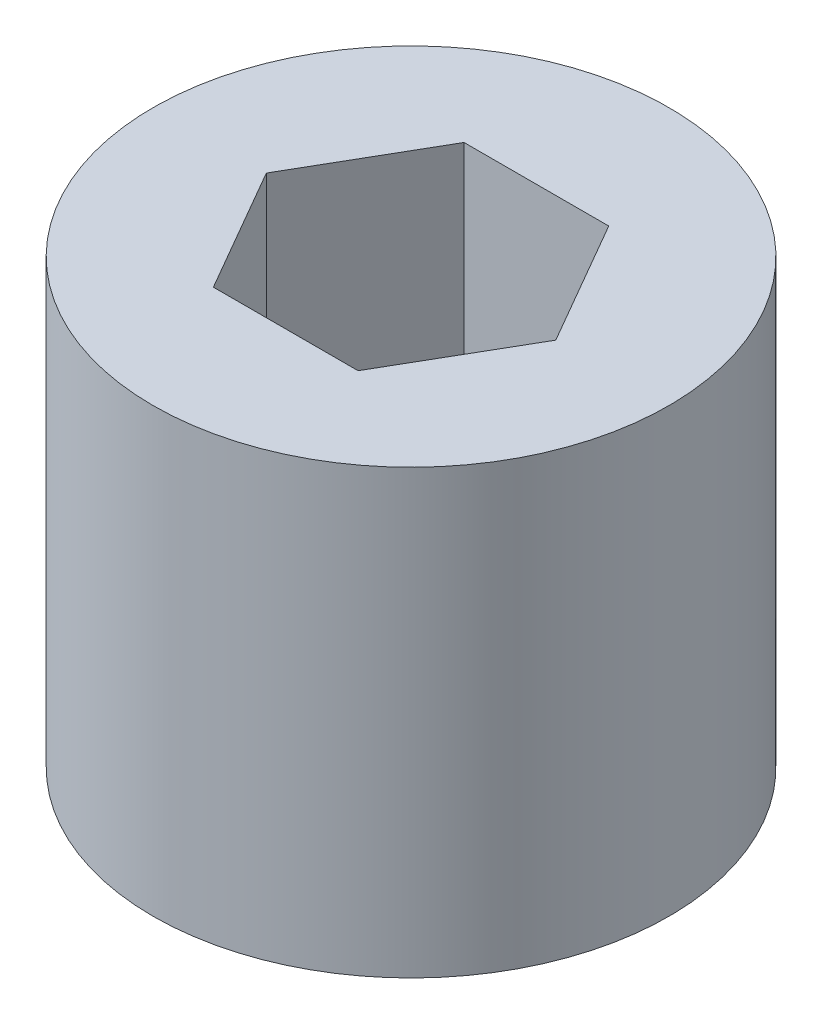
ISO-10303-21;
HEADER;
FILE_DESCRIPTION(('STEP AP214'),'2;1');
FILE_NAME('part.step','',(''),(''),'','','');
FILE_SCHEMA(('AUTOMOTIVE_DESIGN { 1 0 10303 214 1 1 1 1 }'));
ENDSEC;
DATA;
#1=APPLICATION_CONTEXT('core data for automotive mechanical design processes');
#2=APPLICATION_PROTOCOL_DEFINITION('international standard','automotive_design',2000,#1);
#3=PRODUCT_CONTEXT('',#1,'mechanical');
#4=PRODUCT('Part','Part','',(#3));
#5=PRODUCT_RELATED_PRODUCT_CATEGORY('part','',(#4));
#6=PRODUCT_DEFINITION_FORMATION('','',#4);
#7=PRODUCT_DEFINITION_CONTEXT('part definition',#1,'design');
#8=PRODUCT_DEFINITION('design','',#6,#7);
#9=PRODUCT_DEFINITION_SHAPE('','',#8);
#10=(LENGTH_UNIT() NAMED_UNIT(*) SI_UNIT(.MILLI.,.METRE.));
#11=(NAMED_UNIT(*) PLANE_ANGLE_UNIT() SI_UNIT($,.RADIAN.));
#12=(NAMED_UNIT(*) SI_UNIT($,.STERADIAN.) SOLID_ANGLE_UNIT());
#13=UNCERTAINTY_MEASURE_WITH_UNIT(LENGTH_MEASURE(1.E-05),#10,'distance_accuracy_value','');
#14=(GEOMETRIC_REPRESENTATION_CONTEXT(3) GLOBAL_UNCERTAINTY_ASSIGNED_CONTEXT((#13)) GLOBAL_UNIT_ASSIGNED_CONTEXT((#10,
#11,#12)) REPRESENTATION_CONTEXT('',''));
#15=CARTESIAN_POINT('',(0.,0.,0.));
#16=DIRECTION('',(0.,0.,1.));
#17=DIRECTION('',(1.,0.,0.));
#18=AXIS2_PLACEMENT_3D('',#15,#16,#17);
#19=CARTESIAN_POINT('',(0.,15.,0.));
#20=DIRECTION('',(0.,1.,0.));
#21=DIRECTION('',(0.,0.,1.));
#22=AXIS2_PLACEMENT_3D('',#19,#20,#21);
#23=PLANE('',#22);
#24=CARTESIAN_POINT('',(0.,15.,0.));
#25=DIRECTION('',(0.,1.,0.));
#26=DIRECTION('',(0.,0.,1.));
#27=AXIS2_PLACEMENT_3D('',#24,#25,#26);
#28=CIRCLE('',#27,8.75);
#29=CARTESIAN_POINT('',(0.,15.,8.75));
#30=VERTEX_POINT('',#29);
#31=EDGE_CURVE('E11',#30,#30,#28,.T.);
#32=ORIENTED_EDGE('',*,*,#31,.T.);
#33=EDGE_LOOP('',(#32));
#34=FACE_BOUND('',#33,.T.);
#35=DIRECTION('',(-0.5,0.,-0.866025403784439));
#36=VECTOR('',#35,1.);
#37=CARTESIAN_POINT('',(4.90747728811182,15.,0.));
#38=LINE('',#37,#36);
#39=CARTESIAN_POINT('',(4.90747728811182,15.,0.));
#40=VERTEX_POINT('',#39);
#41=CARTESIAN_POINT('',(2.45373864405589,15.,-4.25000000000001));
#42=VERTEX_POINT('',#41);
#43=EDGE_CURVE('E94',#40,#42,#38,.T.);
#44=ORIENTED_EDGE('',*,*,#43,.F.);
#45=DIRECTION('',(0.5,0.,-0.866025403784438));
#46=VECTOR('',#45,1.);
#47=CARTESIAN_POINT('',(2.45373864405593,15.,4.24999999999999));
#48=LINE('',#47,#46);
#49=CARTESIAN_POINT('',(2.45373864405593,15.,4.24999999999999));
#50=VERTEX_POINT('',#49);
#51=EDGE_CURVE('E86',#50,#40,#48,.T.);
#52=ORIENTED_EDGE('',*,*,#51,.F.);
#53=DIRECTION('',(1.,0.,0.));
#54=VECTOR('',#53,1.);
#55=CARTESIAN_POINT('',(-2.45373864405591,15.,4.25));
#56=LINE('',#55,#54);
#57=CARTESIAN_POINT('',(-2.45373864405591,15.,4.25));
#58=VERTEX_POINT('',#57);
#59=EDGE_CURVE('E114',#58,#50,#56,.T.);
#60=ORIENTED_EDGE('',*,*,#59,.F.);
#61=DIRECTION('',(0.5,0.,0.866025403784438));
#62=VECTOR('',#61,1.);
#63=CARTESIAN_POINT('',(-4.90747728811183,15.,0.));
#64=LINE('',#63,#62);
#65=CARTESIAN_POINT('',(-4.90747728811183,15.,0.));
#66=VERTEX_POINT('',#65);
#67=EDGE_CURVE('E112',#66,#58,#64,.T.);
#68=ORIENTED_EDGE('',*,*,#67,.F.);
#69=DIRECTION('',(-0.5,0.,0.866025403784438));
#70=VECTOR('',#69,1.);
#71=CARTESIAN_POINT('',(-2.45373864405591,15.,-4.25000000000001));
#72=LINE('',#71,#70);
#73=CARTESIAN_POINT('',(-2.45373864405591,15.,-4.25000000000001));
#74=VERTEX_POINT('',#73);
#75=EDGE_CURVE('E108',#74,#66,#72,.T.);
#76=ORIENTED_EDGE('',*,*,#75,.F.);
#77=DIRECTION('',(-1.,0.,0.));
#78=VECTOR('',#77,1.);
#79=CARTESIAN_POINT('',(2.45373864405589,15.,-4.25000000000001));
#80=LINE('',#79,#78);
#81=EDGE_CURVE('E106',#42,#74,#80,.T.);
#82=ORIENTED_EDGE('',*,*,#81,.F.);
#83=EDGE_LOOP('',(#44,#52,#60,#68,#76,#82));
#84=FACE_BOUND('',#83,.T.);
#85=ADVANCED_FACE('F33',(#34,#84),#23,.T.);
#86=CARTESIAN_POINT('',(0.,0.,0.));
#87=DIRECTION('',(0.,1.,0.));
#88=DIRECTION('',(0.,0.,1.));
#89=AXIS2_PLACEMENT_3D('',#86,#87,#88);
#90=PLANE('',#89);
#91=CARTESIAN_POINT('',(0.,0.,0.));
#92=DIRECTION('',(0.,1.,0.));
#93=DIRECTION('',(0.,0.,1.));
#94=AXIS2_PLACEMENT_3D('',#91,#92,#93);
#95=CIRCLE('',#94,8.75);
#96=CARTESIAN_POINT('',(0.,0.,8.75));
#97=VERTEX_POINT('',#96);
#98=EDGE_CURVE('E37',#97,#97,#95,.T.);
#99=ORIENTED_EDGE('',*,*,#98,.F.);
#100=EDGE_LOOP('',(#99));
#101=FACE_BOUND('',#100,.T.);
#102=DIRECTION('',(0.5,0.,-0.866025403784438));
#103=VECTOR('',#102,1.);
#104=CARTESIAN_POINT('',(2.45373864405593,0.,4.24999999999999));
#105=LINE('',#104,#103);
#106=CARTESIAN_POINT('',(2.45373864405593,0.,4.24999999999999));
#107=VERTEX_POINT('',#106);
#108=CARTESIAN_POINT('',(4.90747728811182,0.,0.));
#109=VERTEX_POINT('',#108);
#110=EDGE_CURVE('E56',#107,#109,#105,.T.);
#111=ORIENTED_EDGE('',*,*,#110,.T.);
#112=DIRECTION('',(-0.5,0.,-0.866025403784439));
#113=VECTOR('',#112,1.);
#114=CARTESIAN_POINT('',(4.90747728811182,0.,0.));
#115=LINE('',#114,#113);
#116=CARTESIAN_POINT('',(2.45373864405589,0.,-4.25000000000001));
#117=VERTEX_POINT('',#116);
#118=EDGE_CURVE('E101',#109,#117,#115,.T.);
#119=ORIENTED_EDGE('',*,*,#118,.T.);
#120=DIRECTION('',(-1.,0.,0.));
#121=VECTOR('',#120,1.);
#122=CARTESIAN_POINT('',(2.45373864405589,0.,-4.25000000000001));
#123=LINE('',#122,#121);
#124=CARTESIAN_POINT('',(-2.45373864405591,0.,-4.25000000000001));
#125=VERTEX_POINT('',#124);
#126=EDGE_CURVE('E118',#117,#125,#123,.T.);
#127=ORIENTED_EDGE('',*,*,#126,.T.);
#128=DIRECTION('',(-0.5,0.,0.866025403784438));
#129=VECTOR('',#128,1.);
#130=CARTESIAN_POINT('',(-2.45373864405591,0.,-4.25000000000001));
#131=LINE('',#130,#129);
#132=CARTESIAN_POINT('',(-4.90747728811183,0.,0.));
#133=VERTEX_POINT('',#132);
#134=EDGE_CURVE('E121',#125,#133,#131,.T.);
#135=ORIENTED_EDGE('',*,*,#134,.T.);
#136=DIRECTION('',(0.5,0.,0.866025403784438));
#137=VECTOR('',#136,1.);
#138=CARTESIAN_POINT('',(-4.90747728811183,0.,0.));
#139=LINE('',#138,#137);
#140=CARTESIAN_POINT('',(-2.45373864405591,0.,4.25));
#141=VERTEX_POINT('',#140);
#142=EDGE_CURVE('E124',#133,#141,#139,.T.);
#143=ORIENTED_EDGE('',*,*,#142,.T.);
#144=DIRECTION('',(1.,0.,0.));
#145=VECTOR('',#144,1.);
#146=CARTESIAN_POINT('',(-2.45373864405591,0.,4.25));
#147=LINE('',#146,#145);
#148=EDGE_CURVE('E95',#141,#107,#147,.T.);
#149=ORIENTED_EDGE('',*,*,#148,.T.);
#150=EDGE_LOOP('',(#111,#119,#127,#135,#143,#149));
#151=FACE_BOUND('',#150,.T.);
#152=ADVANCED_FACE('F141',(#101,#151),#90,.F.);
#153=CARTESIAN_POINT('',(0.,15.,0.));
#154=DIRECTION('',(0.,-1.,0.));
#155=DIRECTION('',(0.,0.,-1.));
#156=AXIS2_PLACEMENT_3D('',#153,#154,#155);
#157=CYLINDRICAL_SURFACE('',#156,8.75);
#158=ORIENTED_EDGE('',*,*,#31,.F.);
#159=EDGE_LOOP('',(#158));
#160=FACE_BOUND('',#159,.T.);
#161=ORIENTED_EDGE('',*,*,#98,.T.);
#162=EDGE_LOOP('',(#161));
#163=FACE_BOUND('',#162,.T.);
#164=ADVANCED_FACE('F35',(#160,#163),#157,.T.);
#165=CARTESIAN_POINT('',(2.45373864405593,15.,4.24999999999999));
#166=DIRECTION('',(-0.866025403784438,0.,-0.5));
#167=DIRECTION('',(-0.5,0.,0.866025403784438));
#168=AXIS2_PLACEMENT_3D('',#165,#166,#167);
#169=PLANE('',#168);
#170=ORIENTED_EDGE('',*,*,#110,.F.);
#171=DIRECTION('',(0.,-1.,0.));
#172=VECTOR('',#171,1.);
#173=CARTESIAN_POINT('',(2.45373864405593,15.,4.24999999999999));
#174=LINE('',#173,#172);
#175=EDGE_CURVE('E90',#50,#107,#174,.T.);
#176=ORIENTED_EDGE('',*,*,#175,.F.);
#177=ORIENTED_EDGE('',*,*,#51,.T.);
#178=DIRECTION('',(0.,-1.,0.));
#179=VECTOR('',#178,1.);
#180=CARTESIAN_POINT('',(4.90747728811182,15.,0.));
#181=LINE('',#180,#179);
#182=EDGE_CURVE('E89',#40,#109,#181,.T.);
#183=ORIENTED_EDGE('',*,*,#182,.T.);
#184=EDGE_LOOP('',(#170,#176,#177,#183));
#185=FACE_BOUND('',#184,.T.);
#186=ADVANCED_FACE('F88',(#185),#169,.T.);
#187=CARTESIAN_POINT('',(4.90747728811182,15.,0.));
#188=DIRECTION('',(-0.866025403784439,0.,0.5));
#189=DIRECTION('',(0.5,0.,0.866025403784439));
#190=AXIS2_PLACEMENT_3D('',#187,#188,#189);
#191=PLANE('',#190);
#192=ORIENTED_EDGE('',*,*,#118,.F.);
#193=ORIENTED_EDGE('',*,*,#182,.F.);
#194=ORIENTED_EDGE('',*,*,#43,.T.);
#195=DIRECTION('',(0.,-1.,0.));
#196=VECTOR('',#195,1.);
#197=CARTESIAN_POINT('',(2.45373864405589,15.,-4.25000000000001));
#198=LINE('',#197,#196);
#199=EDGE_CURVE('E102',#42,#117,#198,.T.);
#200=ORIENTED_EDGE('',*,*,#199,.T.);
#201=EDGE_LOOP('',(#192,#193,#194,#200));
#202=FACE_BOUND('',#201,.T.);
#203=ADVANCED_FACE('F98',(#202),#191,.T.);
#204=CARTESIAN_POINT('',(2.45373864405589,15.,-4.25000000000001));
#205=DIRECTION('',(0.,0.,1.));
#206=DIRECTION('',(1.,0.,0.));
#207=AXIS2_PLACEMENT_3D('',#204,#205,#206);
#208=PLANE('',#207);
#209=ORIENTED_EDGE('',*,*,#126,.F.);
#210=ORIENTED_EDGE('',*,*,#199,.F.);
#211=ORIENTED_EDGE('',*,*,#81,.T.);
#212=DIRECTION('',(0.,-1.,0.));
#213=VECTOR('',#212,1.);
#214=CARTESIAN_POINT('',(-2.45373864405591,15.,-4.25000000000001));
#215=LINE('',#214,#213);
#216=EDGE_CURVE('E133',#74,#125,#215,.T.);
#217=ORIENTED_EDGE('',*,*,#216,.T.);
#218=EDGE_LOOP('',(#209,#210,#211,#217));
#219=FACE_BOUND('',#218,.T.);
#220=ADVANCED_FACE('F137',(#219),#208,.T.);
#221=CARTESIAN_POINT('',(-2.45373864405591,15.,-4.25000000000001));
#222=DIRECTION('',(0.866025403784438,0.,0.5));
#223=DIRECTION('',(0.5,0.,-0.866025403784439));
#224=AXIS2_PLACEMENT_3D('',#221,#222,#223);
#225=PLANE('',#224);
#226=ORIENTED_EDGE('',*,*,#134,.F.);
#227=ORIENTED_EDGE('',*,*,#216,.F.);
#228=ORIENTED_EDGE('',*,*,#75,.T.);
#229=DIRECTION('',(0.,-1.,0.));
#230=VECTOR('',#229,1.);
#231=CARTESIAN_POINT('',(-4.90747728811183,15.,0.));
#232=LINE('',#231,#230);
#233=EDGE_CURVE('E131',#66,#133,#232,.T.);
#234=ORIENTED_EDGE('',*,*,#233,.T.);
#235=EDGE_LOOP('',(#226,#227,#228,#234));
#236=FACE_BOUND('',#235,.T.);
#237=ADVANCED_FACE('F149',(#236),#225,.T.);
#238=CARTESIAN_POINT('',(-4.90747728811183,15.,0.));
#239=DIRECTION('',(0.866025403784438,0.,-0.5));
#240=DIRECTION('',(-0.5,0.,-0.866025403784439));
#241=AXIS2_PLACEMENT_3D('',#238,#239,#240);
#242=PLANE('',#241);
#243=ORIENTED_EDGE('',*,*,#142,.F.);
#244=ORIENTED_EDGE('',*,*,#233,.F.);
#245=ORIENTED_EDGE('',*,*,#67,.T.);
#246=DIRECTION('',(0.,-1.,0.));
#247=VECTOR('',#246,1.);
#248=CARTESIAN_POINT('',(-2.45373864405591,15.,4.25));
#249=LINE('',#248,#247);
#250=EDGE_CURVE('E48',#58,#141,#249,.T.);
#251=ORIENTED_EDGE('',*,*,#250,.T.);
#252=EDGE_LOOP('',(#243,#244,#245,#251));
#253=FACE_BOUND('',#252,.T.);
#254=ADVANCED_FACE('F147',(#253),#242,.T.);
#255=CARTESIAN_POINT('',(-2.45373864405591,15.,4.25));
#256=DIRECTION('',(0.,0.,-1.));
#257=DIRECTION('',(-1.,0.,0.));
#258=AXIS2_PLACEMENT_3D('',#255,#256,#257);
#259=PLANE('',#258);
#260=ORIENTED_EDGE('',*,*,#148,.F.);
#261=ORIENTED_EDGE('',*,*,#250,.F.);
#262=ORIENTED_EDGE('',*,*,#59,.T.);
#263=ORIENTED_EDGE('',*,*,#175,.T.);
#264=EDGE_LOOP('',(#260,#261,#262,#263));
#265=FACE_BOUND('',#264,.T.);
#266=ADVANCED_FACE('F143',(#265),#259,.T.);
#267=CLOSED_SHELL('',(#85,#152,#164,#186,#203,#220,#237,#254,#266));
#268=MANIFOLD_SOLID_BREP('B2',#267);
#269=ADVANCED_BREP_SHAPE_REPRESENTATION('',(#18,#268),#14);
#270=SHAPE_DEFINITION_REPRESENTATION(#9,#269);
ENDSEC;
END-ISO-10303-21;
